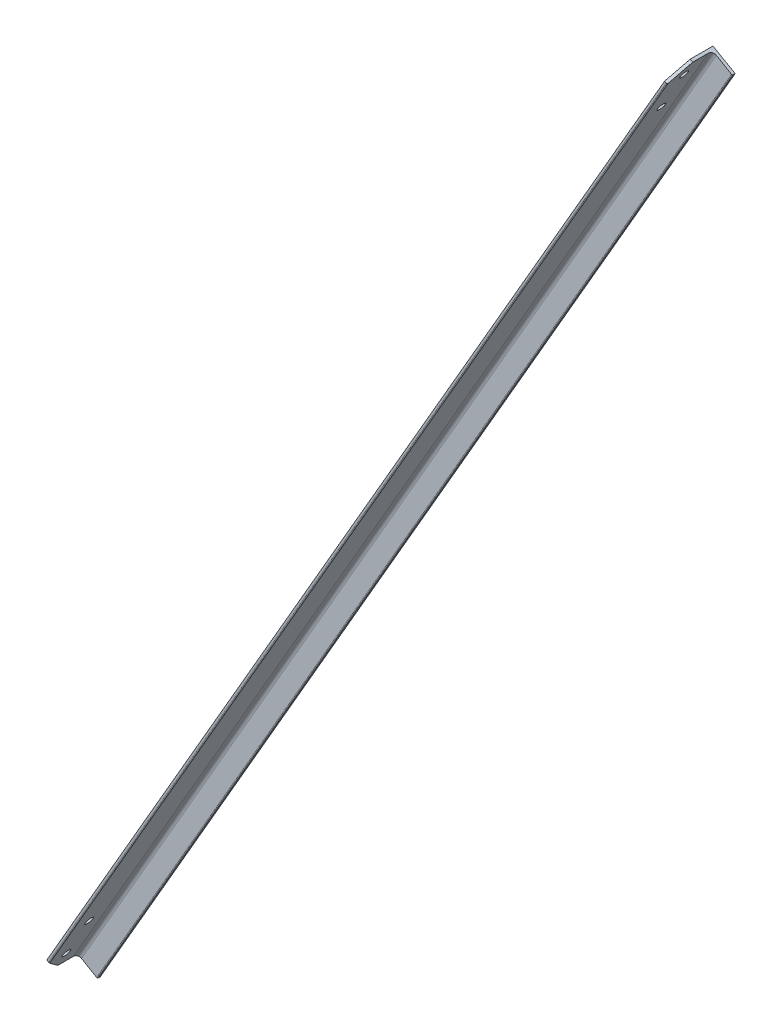
ISO-10303-21;
HEADER;
FILE_DESCRIPTION(('STEP AP214'),'2;1');
FILE_NAME('part.step','',(''),(''),'','','');
FILE_SCHEMA(('AUTOMOTIVE_DESIGN { 1 0 10303 214 1 1 1 1 }'));
ENDSEC;
DATA;
#1=APPLICATION_CONTEXT('core data for automotive mechanical design processes');
#2=APPLICATION_PROTOCOL_DEFINITION('international standard','automotive_design',2000,#1);
#3=PRODUCT_CONTEXT('',#1,'mechanical');
#4=PRODUCT('Part','Part','',(#3));
#5=PRODUCT_RELATED_PRODUCT_CATEGORY('part','',(#4));
#6=PRODUCT_DEFINITION_FORMATION('','',#4);
#7=PRODUCT_DEFINITION_CONTEXT('part definition',#1,'design');
#8=PRODUCT_DEFINITION('design','',#6,#7);
#9=PRODUCT_DEFINITION_SHAPE('','',#8);
#10=(LENGTH_UNIT() NAMED_UNIT(*) SI_UNIT(.MILLI.,.METRE.));
#11=(NAMED_UNIT(*) PLANE_ANGLE_UNIT() SI_UNIT($,.RADIAN.));
#12=(NAMED_UNIT(*) SI_UNIT($,.STERADIAN.) SOLID_ANGLE_UNIT());
#13=UNCERTAINTY_MEASURE_WITH_UNIT(LENGTH_MEASURE(1.E-05),#10,'distance_accuracy_value','');
#14=(GEOMETRIC_REPRESENTATION_CONTEXT(3) GLOBAL_UNCERTAINTY_ASSIGNED_CONTEXT((#13)) GLOBAL_UNIT_ASSIGNED_CONTEXT((#10,
#11,#12)) REPRESENTATION_CONTEXT('',''));
#15=CARTESIAN_POINT('',(0.,0.,0.));
#16=DIRECTION('',(0.,0.,1.));
#17=DIRECTION('',(1.,0.,0.));
#18=AXIS2_PLACEMENT_3D('',#15,#16,#17);
#19=CARTESIAN_POINT('',(2.88386459460233,-1.66499999999958,70.));
#20=DIRECTION('',(0.,0.,-1.));
#21=DIRECTION('',(-1.,0.,0.));
#22=AXIS2_PLACEMENT_3D('',#19,#20,#21);
#23=PLANE('',#22);
#24=DIRECTION('',(0.499999999999998,0.86602540378444,0.));
#25=VECTOR('',#24,1.);
#26=CARTESIAN_POINT('',(2.22044604925031E-13,4.44089209850063E-13,70.));
#27=LINE('',#26,#25);
#28=CARTESIAN_POINT('',(15.0000000000003,25.9807621135338,70.));
#29=VERTEX_POINT('',#28);
#30=CARTESIAN_POINT('',(1099.99999999999,1905.25588832577,70.));
#31=VERTEX_POINT('',#30);
#32=EDGE_CURVE('E167',#29,#31,#27,.T.);
#33=ORIENTED_EDGE('',*,*,#32,.F.);
#34=DIRECTION('',(0.86602540378444,-0.499999999999998,0.));
#35=VECTOR('',#34,1.);
#36=CARTESIAN_POINT('',(17.8838645946024,24.3157621135339,70.));
#37=LINE('',#36,#35);
#38=CARTESIAN_POINT('',(17.8838645946024,24.3157621135339,70.));
#39=VERTEX_POINT('',#38);
#40=EDGE_CURVE('E88',#29,#39,#37,.T.);
#41=ORIENTED_EDGE('',*,*,#40,.T.);
#42=DIRECTION('',(0.499999999999998,0.86602540378444,0.));
#43=VECTOR('',#42,1.);
#44=CARTESIAN_POINT('',(2.88386459460233,-1.66499999999958,70.));
#45=LINE('',#44,#43);
#46=CARTESIAN_POINT('',(1102.8838645946,1903.59088832577,70.));
#47=VERTEX_POINT('',#46);
#48=EDGE_CURVE('E186',#39,#47,#45,.T.);
#49=ORIENTED_EDGE('',*,*,#48,.T.);
#50=DIRECTION('',(-0.86602540378444,0.499999999999998,0.));
#51=VECTOR('',#50,1.);
#52=CARTESIAN_POINT('',(1102.8838645946,1903.59088832577,70.));
#53=LINE('',#52,#51);
#54=EDGE_CURVE('E218',#47,#31,#53,.T.);
#55=ORIENTED_EDGE('',*,*,#54,.T.);
#56=EDGE_LOOP('',(#33,#41,#49,#55));
#57=FACE_BOUND('',#56,.T.);
#58=ADVANCED_FACE('F66',(#57),#23,.F.);
#59=CARTESIAN_POINT('',(2.22044604925031E-13,4.44089209850063E-13,70.));
#60=DIRECTION('',(0.86602540378444,-0.499999999999998,0.));
#61=DIRECTION('',(0.499999999999998,0.86602540378444,0.));
#62=AXIS2_PLACEMENT_3D('',#59,#60,#61);
#63=PLANE('',#62);
#64=CARTESIAN_POINT('',(1060.,1835.97385602301,40.0047232344756));
#65=DIRECTION('',(-0.86602540378444,0.499999999999998,0.));
#66=DIRECTION('',(-0.499999999999998,-0.86602540378444,0.));
#67=AXIS2_PLACEMENT_3D('',#64,#65,#66);
#68=CIRCLE('',#67,7.00000000000025);
#69=CARTESIAN_POINT('',(1056.5,1829.91167819652,40.0047232344756));
#70=VERTEX_POINT('',#69);
#71=EDGE_CURVE('E456',#70,#70,#68,.T.);
#72=ORIENTED_EDGE('',*,*,#71,.F.);
#73=EDGE_LOOP('',(#72));
#74=FACE_BOUND('',#73,.T.);
#75=CARTESIAN_POINT('',(1100.,1905.25588832577,40.0047232344756));
#76=DIRECTION('',(-0.86602540378444,0.499999999999998,0.));
#77=DIRECTION('',(-0.499999999999998,-0.86602540378444,0.));
#78=AXIS2_PLACEMENT_3D('',#75,#76,#77);
#79=CIRCLE('',#78,6.9999999999998);
#80=CARTESIAN_POINT('',(1096.5,1899.19371049928,40.0047232344756));
#81=VERTEX_POINT('',#80);
#82=EDGE_CURVE('E457',#81,#81,#79,.T.);
#83=ORIENTED_EDGE('',*,*,#82,.F.);
#84=EDGE_LOOP('',(#83));
#85=FACE_BOUND('',#84,.T.);
#86=CARTESIAN_POINT('',(14.9999999999998,25.980762113533,40.));
#87=DIRECTION('',(-0.86602540378444,0.499999999999998,0.));
#88=DIRECTION('',(-0.499999999999998,-0.86602540378444,0.));
#89=AXIS2_PLACEMENT_3D('',#86,#87,#88);
#90=CIRCLE('',#89,7.);
#91=CARTESIAN_POINT('',(11.4999999999998,19.9185842870419,40.));
#92=VERTEX_POINT('',#91);
#93=EDGE_CURVE('E445',#92,#92,#90,.T.);
#94=ORIENTED_EDGE('',*,*,#93,.F.);
#95=EDGE_LOOP('',(#94));
#96=FACE_BOUND('',#95,.T.);
#97=CARTESIAN_POINT('',(54.9999999999996,95.2627944162882,40.));
#98=DIRECTION('',(-0.86602540378444,0.499999999999998,0.));
#99=DIRECTION('',(-0.499999999999998,-0.86602540378444,0.));
#100=AXIS2_PLACEMENT_3D('',#97,#98,#99);
#101=CIRCLE('',#100,7.);
#102=CARTESIAN_POINT('',(51.4999999999997,89.2006165897971,40.));
#103=VERTEX_POINT('',#102);
#104=EDGE_CURVE('E440',#103,#103,#101,.T.);
#105=ORIENTED_EDGE('',*,*,#104,.F.);
#106=EDGE_LOOP('',(#105));
#107=FACE_BOUND('',#106,.T.);
#108=DIRECTION('',(0.,0.,-1.));
#109=VECTOR('',#108,1.);
#110=CARTESIAN_POINT('',(2.22044604925031E-13,4.44089209850063E-13,70.));
#111=LINE('',#110,#109);
#112=CARTESIAN_POINT('',(2.22044604925031E-13,4.44089209850063E-13,40.));
#113=VERTEX_POINT('',#112);
#114=CARTESIAN_POINT('',(2.22044604925031E-13,4.44089209850063E-13,0.));
#115=VERTEX_POINT('',#114);
#116=EDGE_CURVE('E148',#113,#115,#111,.T.);
#117=ORIENTED_EDGE('',*,*,#116,.F.);
#118=DIRECTION('',(0.353553390593273,0.612372435695797,0.707106781186546));
#119=VECTOR('',#118,1.);
#120=CARTESIAN_POINT('',(2.63677968348475E-13,5.20417042793042E-13,40.));
#121=LINE('',#120,#119);
#122=EDGE_CURVE('E232',#113,#29,#121,.T.);
#123=ORIENTED_EDGE('',*,*,#122,.T.);
#124=ORIENTED_EDGE('',*,*,#32,.T.);
#125=DIRECTION('',(-0.353553390593271,-0.612372435695792,0.707106781186551));
#126=VECTOR('',#125,1.);
#127=CARTESIAN_POINT('',(1100.,1905.25588832577,70.));
#128=LINE('',#127,#126);
#129=CARTESIAN_POINT('',(1115.,1931.2366504393,39.9999999999993));
#130=VERTEX_POINT('',#129);
#131=EDGE_CURVE('E221',#31,#130,#128,.F.);
#132=ORIENTED_EDGE('',*,*,#131,.T.);
#133=DIRECTION('',(0.,0.,-1.));
#134=VECTOR('',#133,1.);
#135=CARTESIAN_POINT('',(1115.,1931.2366504393,70.));
#136=LINE('',#135,#134);
#137=CARTESIAN_POINT('',(1115.,1931.2366504393,0.));
#138=VERTEX_POINT('',#137);
#139=EDGE_CURVE('E164',#130,#138,#136,.T.);
#140=ORIENTED_EDGE('',*,*,#139,.T.);
#141=DIRECTION('',(0.499999999999998,0.86602540378444,0.));
#142=VECTOR('',#141,1.);
#143=CARTESIAN_POINT('',(2.22044604925031E-13,4.44089209850063E-13,0.));
#144=LINE('',#143,#142);
#145=EDGE_CURVE('E161',#115,#138,#144,.T.);
#146=ORIENTED_EDGE('',*,*,#145,.F.);
#147=EDGE_LOOP('',(#117,#123,#124,#132,#140,#146));
#148=FACE_BOUND('',#147,.T.);
#149=ADVANCED_FACE('F162',(#74,#85,#96,#107,#148),#63,.F.);
#150=CARTESIAN_POINT('',(2.22044604925031E-13,4.44089209850063E-13,0.));
#151=DIRECTION('',(0.,0.,1.));
#152=DIRECTION('',(1.,0.,0.));
#153=AXIS2_PLACEMENT_3D('',#150,#151,#152);
#154=PLANE('',#153);
#155=DIRECTION('',(0.866025403784439,-0.5,0.));
#156=VECTOR('',#155,1.);
#157=CARTESIAN_POINT('',(1115.,1931.2366504393,0.));
#158=LINE('',#157,#156);
#159=CARTESIAN_POINT('',(1153.9711431703,1908.7366504393,0.));
#160=VERTEX_POINT('',#159);
#161=EDGE_CURVE('E188',#138,#160,#158,.T.);
#162=ORIENTED_EDGE('',*,*,#161,.T.);
#163=DIRECTION('',(0.499999999999998,0.86602540378444,0.));
#164=VECTOR('',#163,1.);
#165=CARTESIAN_POINT('',(38.9711431702999,-22.4999999999995,0.));
#166=LINE('',#165,#164);
#167=CARTESIAN_POINT('',(38.9711431702999,-22.4999999999995,0.));
#168=VERTEX_POINT('',#167);
#169=EDGE_CURVE('E168',#168,#160,#166,.T.);
#170=ORIENTED_EDGE('',*,*,#169,.F.);
#171=DIRECTION('',(0.866025403784439,-0.5,0.));
#172=VECTOR('',#171,1.);
#173=CARTESIAN_POINT('',(2.22044604925031E-13,4.44089209850063E-13,0.));
#174=LINE('',#173,#172);
#175=EDGE_CURVE('E153',#115,#168,#174,.T.);
#176=ORIENTED_EDGE('',*,*,#175,.F.);
#177=ORIENTED_EDGE('',*,*,#145,.T.);
#178=EDGE_LOOP('',(#162,#170,#176,#177));
#179=FACE_BOUND('',#178,.T.);
#180=ADVANCED_FACE('F170',(#179),#154,.F.);
#181=CARTESIAN_POINT('',(38.9711431702999,-22.4999999999995,0.));
#182=DIRECTION('',(-0.86602540378444,0.499999999999998,0.));
#183=DIRECTION('',(-0.499999999999998,-0.86602540378444,0.));
#184=AXIS2_PLACEMENT_3D('',#181,#182,#183);
#185=PLANE('',#184);
#186=DIRECTION('',(0.,0.,1.));
#187=VECTOR('',#186,1.);
#188=CARTESIAN_POINT('',(1153.9711431703,1908.7366504393,0.));
#189=LINE('',#188,#187);
#190=CARTESIAN_POINT('',(1153.9711431703,1908.7366504393,3.33));
#191=VERTEX_POINT('',#190);
#192=EDGE_CURVE('E191',#160,#191,#189,.T.);
#193=ORIENTED_EDGE('',*,*,#192,.T.);
#194=DIRECTION('',(0.499999999999998,0.86602540378444,0.));
#195=VECTOR('',#194,1.);
#196=CARTESIAN_POINT('',(38.9711431702999,-22.4999999999995,3.33));
#197=LINE('',#196,#195);
#198=CARTESIAN_POINT('',(38.9711431702999,-22.4999999999995,3.33));
#199=VERTEX_POINT('',#198);
#200=EDGE_CURVE('E213',#199,#191,#197,.T.);
#201=ORIENTED_EDGE('',*,*,#200,.F.);
#202=DIRECTION('',(0.,0.,1.));
#203=VECTOR('',#202,1.);
#204=CARTESIAN_POINT('',(38.9711431702999,-22.4999999999995,0.));
#205=LINE('',#204,#203);
#206=EDGE_CURVE('E173',#168,#199,#205,.T.);
#207=ORIENTED_EDGE('',*,*,#206,.F.);
#208=ORIENTED_EDGE('',*,*,#169,.T.);
#209=EDGE_LOOP('',(#193,#201,#207,#208));
#210=FACE_BOUND('',#209,.T.);
#211=ADVANCED_FACE('F383',(#210),#185,.F.);
#212=CARTESIAN_POINT('',(37.52488074598,-21.6649999999994,3.33));
#213=DIRECTION('',(0.499999999999998,0.86602540378444,0.));
#214=DIRECTION('',(-0.86602540378444,0.499999999999998,0.));
#215=AXIS2_PLACEMENT_3D('',#212,#213,#214);
#216=CYLINDRICAL_SURFACE('',#215,1.66999999999998);
#217=CARTESIAN_POINT('',(1152.52488074598,1909.5716504393,3.33));
#218=DIRECTION('',(-0.499999999999998,-0.86602540378444,0.));
#219=DIRECTION('',(0.86602540378444,-0.499999999999998,0.));
#220=AXIS2_PLACEMENT_3D('',#217,#218,#219);
#221=CIRCLE('',#220,1.66999999999998);
#222=CARTESIAN_POINT('',(1152.52488074598,1909.5716504393,4.99999999999998));
#223=VERTEX_POINT('',#222);
#224=EDGE_CURVE('E193',#191,#223,#221,.T.);
#225=ORIENTED_EDGE('',*,*,#224,.T.);
#226=DIRECTION('',(0.499999999999998,0.86602540378444,0.));
#227=VECTOR('',#226,1.);
#228=CARTESIAN_POINT('',(37.52488074598,-21.6649999999994,4.99999999999998));
#229=LINE('',#228,#227);
#230=CARTESIAN_POINT('',(37.52488074598,-21.6649999999994,4.99999999999998));
#231=VERTEX_POINT('',#230);
#232=EDGE_CURVE('E210',#231,#223,#229,.T.);
#233=ORIENTED_EDGE('',*,*,#232,.F.);
#234=CARTESIAN_POINT('',(37.52488074598,-21.6649999999994,3.33));
#235=DIRECTION('',(-0.499999999999998,-0.86602540378444,0.));
#236=DIRECTION('',(0.86602540378444,-0.499999999999998,0.));
#237=AXIS2_PLACEMENT_3D('',#234,#235,#236);
#238=CIRCLE('',#237,1.66999999999998);
#239=EDGE_CURVE('E175',#199,#231,#238,.T.);
#240=ORIENTED_EDGE('',*,*,#239,.F.);
#241=ORIENTED_EDGE('',*,*,#200,.T.);
#242=EDGE_LOOP('',(#225,#233,#240,#241));
#243=FACE_BOUND('',#242,.T.);
#244=ADVANCED_FACE('F391',(#243),#216,.T.);
#245=CARTESIAN_POINT('',(37.52488074598,-21.6649999999994,5.));
#246=DIRECTION('',(0.,0.,-1.));
#247=DIRECTION('',(-1.,0.,0.));
#248=AXIS2_PLACEMENT_3D('',#245,#246,#247);
#249=PLANE('',#248);
#250=DIRECTION('',(-0.866025403784444,0.499999999999991,0.));
#251=VECTOR('',#250,1.);
#252=CARTESIAN_POINT('',(1152.52488074598,1909.5716504393,5.));
#253=LINE('',#252,#251);
#254=CARTESIAN_POINT('',(1125.8253175473,1924.9866504393,5.));
#255=VERTEX_POINT('',#254);
#256=EDGE_CURVE('E195',#223,#255,#253,.T.);
#257=ORIENTED_EDGE('',*,*,#256,.T.);
#258=DIRECTION('',(0.499999999999998,0.86602540378444,0.));
#259=VECTOR('',#258,1.);
#260=CARTESIAN_POINT('',(10.8253175473056,-6.24999999999964,5.));
#261=LINE('',#260,#259);
#262=CARTESIAN_POINT('',(10.8253175473056,-6.24999999999964,5.));
#263=VERTEX_POINT('',#262);
#264=EDGE_CURVE('E207',#263,#255,#261,.T.);
#265=ORIENTED_EDGE('',*,*,#264,.F.);
#266=DIRECTION('',(-0.866025403784444,0.499999999999991,0.));
#267=VECTOR('',#266,1.);
#268=CARTESIAN_POINT('',(37.52488074598,-21.6649999999994,5.));
#269=LINE('',#268,#267);
#270=EDGE_CURVE('E180',#231,#263,#269,.T.);
#271=ORIENTED_EDGE('',*,*,#270,.F.);
#272=ORIENTED_EDGE('',*,*,#232,.T.);
#273=EDGE_LOOP('',(#257,#265,#271,#272));
#274=FACE_BOUND('',#273,.T.);
#275=ADVANCED_FACE('F401',(#274),#249,.F.);
#276=CARTESIAN_POINT('',(10.8253175473056,-6.24999999999942,12.5));
#277=DIRECTION('',(0.499999999999998,0.86602540378444,0.));
#278=DIRECTION('',(-0.86602540378444,0.499999999999998,0.));
#279=AXIS2_PLACEMENT_3D('',#276,#277,#278);
#280=CYLINDRICAL_SURFACE('',#279,7.49999999999995);
#281=CARTESIAN_POINT('',(1125.8253175473,1924.9866504393,12.5));
#282=DIRECTION('',(0.499999999999998,0.86602540378444,0.));
#283=DIRECTION('',(-0.86602540378444,0.499999999999998,0.));
#284=AXIS2_PLACEMENT_3D('',#281,#282,#283);
#285=CIRCLE('',#284,7.49999999999995);
#286=CARTESIAN_POINT('',(1119.33012701892,1928.7366504393,12.5));
#287=VERTEX_POINT('',#286);
#288=EDGE_CURVE('E197',#255,#287,#285,.T.);
#289=ORIENTED_EDGE('',*,*,#288,.T.);
#290=DIRECTION('',(0.499999999999998,0.86602540378444,0.));
#291=VECTOR('',#290,1.);
#292=CARTESIAN_POINT('',(4.33012701892244,-2.4999999999995,12.5));
#293=LINE('',#292,#291);
#294=CARTESIAN_POINT('',(4.33012701892244,-2.4999999999995,12.5));
#295=VERTEX_POINT('',#294);
#296=EDGE_CURVE('E204',#295,#287,#293,.T.);
#297=ORIENTED_EDGE('',*,*,#296,.F.);
#298=CARTESIAN_POINT('',(10.8253175473056,-6.24999999999942,12.5));
#299=DIRECTION('',(0.499999999999998,0.86602540378444,0.));
#300=DIRECTION('',(-0.86602540378444,0.499999999999998,0.));
#301=AXIS2_PLACEMENT_3D('',#298,#299,#300);
#302=CIRCLE('',#301,7.49999999999995);
#303=EDGE_CURVE('E182',#263,#295,#302,.T.);
#304=ORIENTED_EDGE('',*,*,#303,.F.);
#305=ORIENTED_EDGE('',*,*,#264,.T.);
#306=EDGE_LOOP('',(#289,#297,#304,#305));
#307=FACE_BOUND('',#306,.T.);
#308=ADVANCED_FACE('F246',(#307),#280,.F.);
#309=CARTESIAN_POINT('',(4.33012701892244,-2.4999999999995,12.5));
#310=DIRECTION('',(-0.86602540378444,0.499999999999998,0.));
#311=DIRECTION('',(-0.499999999999998,-0.86602540378444,0.));
#312=AXIS2_PLACEMENT_3D('',#309,#310,#311);
#313=PLANE('',#312);
#314=CARTESIAN_POINT('',(1064.33012701892,1833.47385602301,40.0047232344756));
#315=DIRECTION('',(-0.86602540378444,0.499999999999998,0.));
#316=DIRECTION('',(-0.499999999999998,-0.86602540378444,0.));
#317=AXIS2_PLACEMENT_3D('',#314,#315,#316);
#318=CIRCLE('',#317,7.00000000000025);
#319=CARTESIAN_POINT('',(1060.83012701892,1827.41167819652,40.0047232344756));
#320=VERTEX_POINT('',#319);
#321=EDGE_CURVE('E448',#320,#320,#318,.F.);
#322=ORIENTED_EDGE('',*,*,#321,.F.);
#323=EDGE_LOOP('',(#322));
#324=FACE_BOUND('',#323,.T.);
#325=CARTESIAN_POINT('',(1104.33012701892,1902.75588832577,40.0047232344756));
#326=DIRECTION('',(-0.86602540378444,0.499999999999998,0.));
#327=DIRECTION('',(-0.499999999999998,-0.86602540378444,0.));
#328=AXIS2_PLACEMENT_3D('',#325,#326,#327);
#329=CIRCLE('',#328,6.9999999999998);
#330=CARTESIAN_POINT('',(1100.83012701892,1896.69371049928,40.0047232344756));
#331=VERTEX_POINT('',#330);
#332=EDGE_CURVE('E453',#331,#331,#329,.F.);
#333=ORIENTED_EDGE('',*,*,#332,.F.);
#334=EDGE_LOOP('',(#333));
#335=FACE_BOUND('',#334,.T.);
#336=CARTESIAN_POINT('',(19.3301270189219,23.480762113533,40.));
#337=DIRECTION('',(-0.86602540378444,0.499999999999998,0.));
#338=DIRECTION('',(-0.499999999999998,-0.86602540378444,0.));
#339=AXIS2_PLACEMENT_3D('',#336,#337,#338);
#340=CIRCLE('',#339,7.);
#341=CARTESIAN_POINT('',(15.8301270189219,17.4185842870419,40.));
#342=VERTEX_POINT('',#341);
#343=EDGE_CURVE('E189',#342,#342,#340,.F.);
#344=ORIENTED_EDGE('',*,*,#343,.F.);
#345=EDGE_LOOP('',(#344));
#346=FACE_BOUND('',#345,.T.);
#347=CARTESIAN_POINT('',(59.3301270189219,92.7627944162881,40.));
#348=DIRECTION('',(-0.86602540378444,0.499999999999998,0.));
#349=DIRECTION('',(-0.499999999999998,-0.86602540378444,0.));
#350=AXIS2_PLACEMENT_3D('',#347,#348,#349);
#351=CIRCLE('',#350,7.);
#352=CARTESIAN_POINT('',(55.8301270189219,86.700616589797,40.));
#353=VERTEX_POINT('',#352);
#354=EDGE_CURVE('E443',#353,#353,#351,.F.);
#355=ORIENTED_EDGE('',*,*,#354,.F.);
#356=EDGE_LOOP('',(#355));
#357=FACE_BOUND('',#356,.T.);
#358=DIRECTION('',(0.499999999999998,0.86602540378444,0.));
#359=VECTOR('',#358,1.);
#360=CARTESIAN_POINT('',(4.33012701892244,-2.4999999999995,68.33));
#361=LINE('',#360,#359);
#362=CARTESIAN_POINT('',(18.4951270189225,22.0344996892138,68.33));
#363=VERTEX_POINT('',#362);
#364=CARTESIAN_POINT('',(1105.16512701892,1904.20215075009,68.33));
#365=VERTEX_POINT('',#364);
#366=EDGE_CURVE('E202',#363,#365,#361,.T.);
#367=ORIENTED_EDGE('',*,*,#366,.F.);
#368=DIRECTION('',(-0.353553390593273,-0.612372435695797,-0.707106781186546));
#369=VECTOR('',#368,1.);
#370=CARTESIAN_POINT('',(4.33012701892246,-2.49999999999946,40.));
#371=LINE('',#370,#369);
#372=CARTESIAN_POINT('',(4.33012701892244,-2.4999999999995,40.));
#373=VERTEX_POINT('',#372);
#374=EDGE_CURVE('E13',#363,#373,#371,.T.);
#375=ORIENTED_EDGE('',*,*,#374,.T.);
#376=DIRECTION('',(0.,0.,1.));
#377=VECTOR('',#376,1.);
#378=CARTESIAN_POINT('',(4.33012701892244,-2.4999999999995,12.5));
#379=LINE('',#378,#377);
#380=EDGE_CURVE('E184',#295,#373,#379,.T.);
#381=ORIENTED_EDGE('',*,*,#380,.F.);
#382=ORIENTED_EDGE('',*,*,#296,.T.);
#383=DIRECTION('',(0.,0.,1.));
#384=VECTOR('',#383,1.);
#385=CARTESIAN_POINT('',(1119.33012701892,1928.7366504393,12.5));
#386=LINE('',#385,#384);
#387=CARTESIAN_POINT('',(1119.33012701892,1928.7366504393,39.9999999999993));
#388=VERTEX_POINT('',#387);
#389=EDGE_CURVE('E158',#287,#388,#386,.T.);
#390=ORIENTED_EDGE('',*,*,#389,.T.);
#391=DIRECTION('',(0.353553390593271,0.612372435695792,-0.707106781186551));
#392=VECTOR('',#391,1.);
#393=CARTESIAN_POINT('',(1104.33012701892,1902.75588832577,70.));
#394=LINE('',#393,#392);
#395=EDGE_CURVE('E225',#388,#365,#394,.F.);
#396=ORIENTED_EDGE('',*,*,#395,.T.);
#397=EDGE_LOOP('',(#367,#375,#381,#382,#390,#396));
#398=FACE_BOUND('',#397,.T.);
#399=ADVANCED_FACE('F240',(#324,#335,#346,#357,#398),#313,.F.);
#400=CARTESIAN_POINT('',(2.88386459460233,-1.66499999999958,68.33));
#401=DIRECTION('',(0.499999999999998,0.86602540378444,0.));
#402=DIRECTION('',(-0.86602540378444,0.499999999999998,0.));
#403=AXIS2_PLACEMENT_3D('',#400,#401,#402);
#404=CYLINDRICAL_SURFACE('',#403,1.67000000000002);
#405=ORIENTED_EDGE('',*,*,#48,.F.);
#406=CARTESIAN_POINT('',(17.0488645946024,22.8694996892138,68.33));
#407=DIRECTION('',(-0.353553390593272,-0.612372435695794,0.707106781186549));
#408=DIRECTION('',(0.353553390593273,0.612372435695797,0.707106781186546));
#409=AXIS2_PLACEMENT_3D('',#406,#407,#408);
#410=ELLIPSE('',#409,2.36173664916311,1.67000000000002);
#411=EDGE_CURVE('E74',#39,#363,#410,.F.);
#412=ORIENTED_EDGE('',*,*,#411,.T.);
#413=ORIENTED_EDGE('',*,*,#366,.T.);
#414=CARTESIAN_POINT('',(1103.7188645946,1905.03715075009,68.33));
#415=DIRECTION('',(-0.353553390593274,-0.612372435695798,-0.707106781186544));
#416=DIRECTION('',(0.353553390593271,0.612372435695792,-0.707106781186551));
#417=AXIS2_PLACEMENT_3D('',#414,#415,#416);
#418=ELLIPSE('',#417,2.36173664916309,1.67000000000002);
#419=EDGE_CURVE('E228',#365,#47,#418,.T.);
#420=ORIENTED_EDGE('',*,*,#419,.T.);
#421=EDGE_LOOP('',(#405,#412,#413,#420));
#422=FACE_BOUND('',#421,.T.);
#423=ADVANCED_FACE('F257',(#422),#404,.T.);
#424=CARTESIAN_POINT('',(37.52488074598,-21.6649999999994,3.33));
#425=DIRECTION('',(-0.499999999999998,-0.86602540378444,0.));
#426=DIRECTION('',(0.86602540378444,-0.499999999999998,0.));
#427=AXIS2_PLACEMENT_3D('',#424,#425,#426);
#428=PLANE('',#427);
#429=ORIENTED_EDGE('',*,*,#380,.T.);
#430=DIRECTION('',(-0.86602540378444,0.499999999999998,0.));
#431=VECTOR('',#430,1.);
#432=CARTESIAN_POINT('',(2.6675754509592E-13,5.2071404201743E-13,40.));
#433=LINE('',#432,#431);
#434=EDGE_CURVE('E156',#373,#113,#433,.T.);
#435=ORIENTED_EDGE('',*,*,#434,.T.);
#436=ORIENTED_EDGE('',*,*,#116,.T.);
#437=ORIENTED_EDGE('',*,*,#175,.T.);
#438=ORIENTED_EDGE('',*,*,#206,.T.);
#439=ORIENTED_EDGE('',*,*,#239,.T.);
#440=ORIENTED_EDGE('',*,*,#270,.T.);
#441=ORIENTED_EDGE('',*,*,#303,.T.);
#442=EDGE_LOOP('',(#429,#435,#436,#437,#438,#439,#440,#441));
#443=FACE_BOUND('',#442,.T.);
#444=ADVANCED_FACE('F151',(#443),#428,.T.);
#445=CARTESIAN_POINT('',(1152.52488074598,1909.5716504393,3.33));
#446=DIRECTION('',(-0.499999999999998,-0.86602540378444,0.));
#447=DIRECTION('',(0.86602540378444,-0.499999999999998,0.));
#448=AXIS2_PLACEMENT_3D('',#445,#446,#447);
#449=PLANE('',#448);
#450=ORIENTED_EDGE('',*,*,#139,.F.);
#451=DIRECTION('',(0.86602540378444,-0.499999999999998,0.));
#452=VECTOR('',#451,1.);
#453=CARTESIAN_POINT('',(1152.52488074598,1909.5716504393,39.9999999999993));
#454=LINE('',#453,#452);
#455=EDGE_CURVE('E223',#130,#388,#454,.T.);
#456=ORIENTED_EDGE('',*,*,#455,.T.);
#457=ORIENTED_EDGE('',*,*,#389,.F.);
#458=ORIENTED_EDGE('',*,*,#288,.F.);
#459=ORIENTED_EDGE('',*,*,#256,.F.);
#460=ORIENTED_EDGE('',*,*,#224,.F.);
#461=ORIENTED_EDGE('',*,*,#192,.F.);
#462=ORIENTED_EDGE('',*,*,#161,.F.);
#463=EDGE_LOOP('',(#450,#456,#457,#458,#459,#460,#461,#462));
#464=FACE_BOUND('',#463,.T.);
#465=ADVANCED_FACE('F251',(#464),#449,.F.);
#466=CARTESIAN_POINT('',(930.222326183,-410.047051206235,40.));
#467=DIRECTION('',(-0.86602540378444,0.499999999999998,0.));
#468=DIRECTION('',(-0.499999999999998,-0.86602540378444,0.));
#469=AXIS2_PLACEMENT_3D('',#466,#467,#468);
#470=CYLINDRICAL_SURFACE('',#469,7.);
#471=ORIENTED_EDGE('',*,*,#104,.T.);
#472=EDGE_LOOP('',(#471));
#473=FACE_BOUND('',#472,.T.);
#474=ORIENTED_EDGE('',*,*,#354,.T.);
#475=EDGE_LOOP('',(#474));
#476=FACE_BOUND('',#475,.T.);
#477=ADVANCED_FACE('F296',(#473,#476),#470,.F.);
#478=CARTESIAN_POINT('',(890.222326183,-479.32908350899,40.));
#479=DIRECTION('',(-0.86602540378444,0.499999999999998,0.));
#480=DIRECTION('',(-0.499999999999998,-0.86602540378444,0.));
#481=AXIS2_PLACEMENT_3D('',#478,#479,#480);
#482=CYLINDRICAL_SURFACE('',#481,7.);
#483=ORIENTED_EDGE('',*,*,#93,.T.);
#484=EDGE_LOOP('',(#483));
#485=FACE_BOUND('',#484,.T.);
#486=ORIENTED_EDGE('',*,*,#343,.T.);
#487=EDGE_LOOP('',(#486));
#488=FACE_BOUND('',#487,.T.);
#489=ADVANCED_FACE('F288',(#485,#488),#482,.F.);
#490=CARTESIAN_POINT('',(1975.222326183,1399.94604270325,40.0047232344756));
#491=DIRECTION('',(-0.86602540378444,0.499999999999998,0.));
#492=DIRECTION('',(-0.499999999999998,-0.86602540378444,0.));
#493=AXIS2_PLACEMENT_3D('',#490,#491,#492);
#494=CYLINDRICAL_SURFACE('',#493,6.9999999999998);
#495=ORIENTED_EDGE('',*,*,#82,.T.);
#496=EDGE_LOOP('',(#495));
#497=FACE_BOUND('',#496,.T.);
#498=ORIENTED_EDGE('',*,*,#332,.T.);
#499=EDGE_LOOP('',(#498));
#500=FACE_BOUND('',#499,.T.);
#501=ADVANCED_FACE('F282',(#497,#500),#494,.F.);
#502=CARTESIAN_POINT('',(1935.222326183,1330.66401040049,40.0047232344756));
#503=DIRECTION('',(-0.86602540378444,0.499999999999998,0.));
#504=DIRECTION('',(-0.499999999999998,-0.86602540378444,0.));
#505=AXIS2_PLACEMENT_3D('',#502,#503,#504);
#506=CYLINDRICAL_SURFACE('',#505,7.00000000000025);
#507=ORIENTED_EDGE('',*,*,#71,.T.);
#508=EDGE_LOOP('',(#507));
#509=FACE_BOUND('',#508,.T.);
#510=ORIENTED_EDGE('',*,*,#321,.T.);
#511=EDGE_LOOP('',(#510));
#512=FACE_BOUND('',#511,.T.);
#513=ADVANCED_FACE('F277',(#509,#512),#506,.F.);
#514=CARTESIAN_POINT('',(1102.8838645946,1903.59088832577,70.));
#515=DIRECTION('',(-0.353553390593274,-0.612372435695798,-0.707106781186544));
#516=DIRECTION('',(-0.86602540378444,0.499999999999998,0.));
#517=AXIS2_PLACEMENT_3D('',#514,#515,#516);
#518=PLANE('',#517);
#519=ORIENTED_EDGE('',*,*,#395,.F.);
#520=ORIENTED_EDGE('',*,*,#455,.F.);
#521=ORIENTED_EDGE('',*,*,#131,.F.);
#522=ORIENTED_EDGE('',*,*,#54,.F.);
#523=ORIENTED_EDGE('',*,*,#419,.F.);
#524=EDGE_LOOP('',(#519,#520,#521,#522,#523));
#525=FACE_BOUND('',#524,.T.);
#526=ADVANCED_FACE('F255',(#525),#518,.F.);
#527=CARTESIAN_POINT('',(37.52488074598,-21.6649999999994,40.));
#528=DIRECTION('',(-0.353553390593272,-0.612372435695794,0.707106781186549));
#529=DIRECTION('',(0.86602540378444,-0.499999999999998,0.));
#530=AXIS2_PLACEMENT_3D('',#527,#528,#529);
#531=PLANE('',#530);
#532=ORIENTED_EDGE('',*,*,#411,.F.);
#533=ORIENTED_EDGE('',*,*,#40,.F.);
#534=ORIENTED_EDGE('',*,*,#122,.F.);
#535=ORIENTED_EDGE('',*,*,#434,.F.);
#536=ORIENTED_EDGE('',*,*,#374,.F.);
#537=EDGE_LOOP('',(#532,#533,#534,#535,#536));
#538=FACE_BOUND('',#537,.T.);
#539=ADVANCED_FACE('F68',(#538),#531,.T.);
#540=CLOSED_SHELL('',(#58,#149,#180,#211,#244,#275,#308,#399,#423,#444,#465,#477,#489,#501,#513,
#526,#539));
#541=MANIFOLD_SOLID_BREP('B2',#540);
#542=ADVANCED_BREP_SHAPE_REPRESENTATION('',(#18,#541),#14);
#543=SHAPE_DEFINITION_REPRESENTATION(#9,#542);
ENDSEC;
END-ISO-10303-21;
